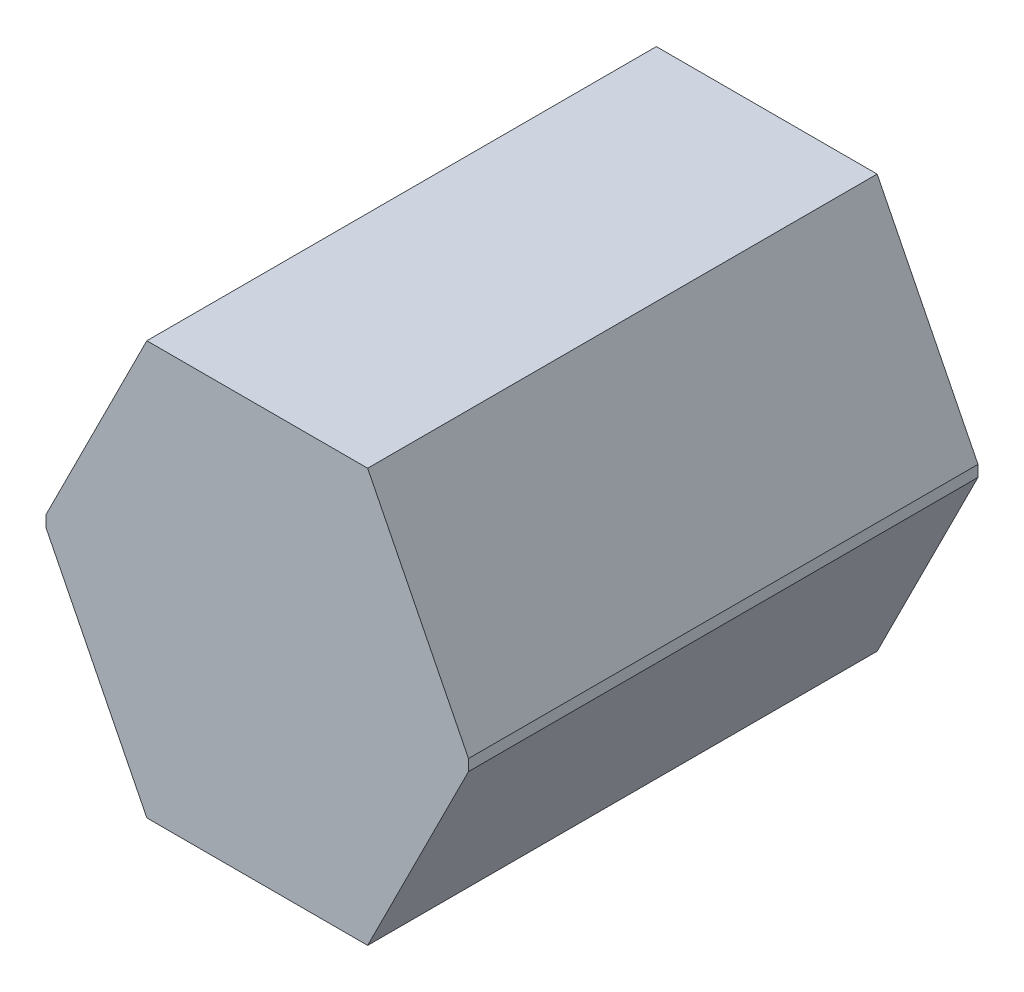
ISO-10303-21;
HEADER;
FILE_DESCRIPTION(('STEP AP214'),'2;1');
FILE_NAME('part.step','',(''),(''),'','','');
FILE_SCHEMA(('AUTOMOTIVE_DESIGN { 1 0 10303 214 1 1 1 1 }'));
ENDSEC;
DATA;
#1=APPLICATION_CONTEXT('core data for automotive mechanical design processes');
#2=APPLICATION_PROTOCOL_DEFINITION('international standard','automotive_design',2000,#1);
#3=PRODUCT_CONTEXT('',#1,'mechanical');
#4=PRODUCT('Part','Part','',(#3));
#5=PRODUCT_RELATED_PRODUCT_CATEGORY('part','',(#4));
#6=PRODUCT_DEFINITION_FORMATION('','',#4);
#7=PRODUCT_DEFINITION_CONTEXT('part definition',#1,'design');
#8=PRODUCT_DEFINITION('design','',#6,#7);
#9=PRODUCT_DEFINITION_SHAPE('','',#8);
#10=(LENGTH_UNIT() NAMED_UNIT(*) SI_UNIT(.MILLI.,.METRE.));
#11=(NAMED_UNIT(*) PLANE_ANGLE_UNIT() SI_UNIT($,.RADIAN.));
#12=(NAMED_UNIT(*) SI_UNIT($,.STERADIAN.) SOLID_ANGLE_UNIT());
#13=UNCERTAINTY_MEASURE_WITH_UNIT(LENGTH_MEASURE(1.E-05),#10,'distance_accuracy_value','');
#14=(GEOMETRIC_REPRESENTATION_CONTEXT(3) GLOBAL_UNCERTAINTY_ASSIGNED_CONTEXT((#13)) GLOBAL_UNIT_ASSIGNED_CONTEXT((#10,
#11,#12)) REPRESENTATION_CONTEXT('',''));
#15=CARTESIAN_POINT('',(0.,0.,0.));
#16=DIRECTION('',(0.,0.,1.));
#17=DIRECTION('',(1.,0.,0.));
#18=AXIS2_PLACEMENT_3D('',#15,#16,#17);
#19=CARTESIAN_POINT('',(97.5,182.5,450.));
#20=DIRECTION('',(-0.893764332552954,-0.448536863430613,0.));
#21=DIRECTION('',(0.448536863430613,-0.893764332552954,0.));
#22=AXIS2_PLACEMENT_3D('',#19,#20,#21);
#23=PLANE('',#22);
#24=DIRECTION('',(-0.448536863430613,0.893764332552954,0.));
#25=VECTOR('',#24,1.);
#26=CARTESIAN_POINT('',(97.5,182.5,0.));
#27=LINE('',#26,#25);
#28=CARTESIAN_POINT('',(186.578619899186,5.,0.));
#29=VERTEX_POINT('',#28);
#30=CARTESIAN_POINT('',(97.5,182.5,0.));
#31=VERTEX_POINT('',#30);
#32=EDGE_CURVE('E133',#29,#31,#27,.T.);
#33=ORIENTED_EDGE('',*,*,#32,.T.);
#34=DIRECTION('',(0.,0.,-1.));
#35=VECTOR('',#34,1.);
#36=CARTESIAN_POINT('',(97.5,182.5,450.));
#37=LINE('',#36,#35);
#38=CARTESIAN_POINT('',(97.5,182.5,450.));
#39=VERTEX_POINT('',#38);
#40=EDGE_CURVE('E11',#39,#31,#37,.T.);
#41=ORIENTED_EDGE('',*,*,#40,.F.);
#42=DIRECTION('',(-0.448536863430613,0.893764332552954,0.));
#43=VECTOR('',#42,1.);
#44=CARTESIAN_POINT('',(97.5,182.5,450.));
#45=LINE('',#44,#43);
#46=CARTESIAN_POINT('',(186.578619899186,5.,450.));
#47=VERTEX_POINT('',#46);
#48=EDGE_CURVE('E147',#47,#39,#45,.T.);
#49=ORIENTED_EDGE('',*,*,#48,.F.);
#50=DIRECTION('',(0.,0.,-1.));
#51=VECTOR('',#50,1.);
#52=CARTESIAN_POINT('',(186.578619899186,5.,450.));
#53=LINE('',#52,#51);
#54=EDGE_CURVE('E129',#47,#29,#53,.T.);
#55=ORIENTED_EDGE('',*,*,#54,.T.);
#56=EDGE_LOOP('',(#33,#41,#49,#55));
#57=FACE_BOUND('',#56,.T.);
#58=ADVANCED_FACE('F37',(#57),#23,.F.);
#59=CARTESIAN_POINT('',(-97.5,182.5,450.));
#60=DIRECTION('',(0.,-1.,0.));
#61=DIRECTION('',(0.,0.,-1.));
#62=AXIS2_PLACEMENT_3D('',#59,#60,#61);
#63=PLANE('',#62);
#64=DIRECTION('',(-1.,0.,0.));
#65=VECTOR('',#64,1.);
#66=CARTESIAN_POINT('',(-97.5,182.5,0.));
#67=LINE('',#66,#65);
#68=CARTESIAN_POINT('',(-97.5,182.5,0.));
#69=VERTEX_POINT('',#68);
#70=EDGE_CURVE('E136',#31,#69,#67,.T.);
#71=ORIENTED_EDGE('',*,*,#70,.T.);
#72=DIRECTION('',(0.,0.,-1.));
#73=VECTOR('',#72,1.);
#74=CARTESIAN_POINT('',(-97.5,182.5,450.));
#75=LINE('',#74,#73);
#76=CARTESIAN_POINT('',(-97.5,182.5,450.));
#77=VERTEX_POINT('',#76);
#78=EDGE_CURVE('E45',#77,#69,#75,.T.);
#79=ORIENTED_EDGE('',*,*,#78,.F.);
#80=DIRECTION('',(-1.,0.,0.));
#81=VECTOR('',#80,1.);
#82=CARTESIAN_POINT('',(-97.5,182.5,450.));
#83=LINE('',#82,#81);
#84=EDGE_CURVE('E96',#39,#77,#83,.T.);
#85=ORIENTED_EDGE('',*,*,#84,.F.);
#86=ORIENTED_EDGE('',*,*,#40,.T.);
#87=EDGE_LOOP('',(#71,#79,#85,#86));
#88=FACE_BOUND('',#87,.T.);
#89=ADVANCED_FACE('F182',(#88),#63,.F.);
#90=CARTESIAN_POINT('',(-97.5,182.5,450.));
#91=DIRECTION('',(0.893764332552954,-0.448536863430613,0.));
#92=DIRECTION('',(0.448536863430613,0.893764332552954,0.));
#93=AXIS2_PLACEMENT_3D('',#90,#91,#92);
#94=PLANE('',#93);
#95=DIRECTION('',(-0.448536863430613,-0.893764332552954,0.));
#96=VECTOR('',#95,1.);
#97=CARTESIAN_POINT('',(-97.5,182.5,0.));
#98=LINE('',#97,#96);
#99=CARTESIAN_POINT('',(-186.578619899186,5.,0.));
#100=VERTEX_POINT('',#99);
#101=EDGE_CURVE('E138',#69,#100,#98,.T.);
#102=ORIENTED_EDGE('',*,*,#101,.T.);
#103=DIRECTION('',(0.,0.,-1.));
#104=VECTOR('',#103,1.);
#105=CARTESIAN_POINT('',(-186.578619899186,5.,450.));
#106=LINE('',#105,#104);
#107=CARTESIAN_POINT('',(-186.578619899186,5.,450.));
#108=VERTEX_POINT('',#107);
#109=EDGE_CURVE('E154',#108,#100,#106,.T.);
#110=ORIENTED_EDGE('',*,*,#109,.F.);
#111=DIRECTION('',(-0.448536863430613,-0.893764332552954,0.));
#112=VECTOR('',#111,1.);
#113=CARTESIAN_POINT('',(-97.5,182.5,450.));
#114=LINE('',#113,#112);
#115=EDGE_CURVE('E162',#77,#108,#114,.T.);
#116=ORIENTED_EDGE('',*,*,#115,.F.);
#117=ORIENTED_EDGE('',*,*,#78,.T.);
#118=EDGE_LOOP('',(#102,#110,#116,#117));
#119=FACE_BOUND('',#118,.T.);
#120=ADVANCED_FACE('F160',(#119),#94,.F.);
#121=CARTESIAN_POINT('',(-186.578619899186,5.,450.));
#122=DIRECTION('',(1.,0.,0.));
#123=DIRECTION('',(0.,0.,-1.));
#124=AXIS2_PLACEMENT_3D('',#121,#122,#123);
#125=PLANE('',#124);
#126=DIRECTION('',(0.,-1.,0.));
#127=VECTOR('',#126,1.);
#128=CARTESIAN_POINT('',(-186.578619899186,5.,0.));
#129=LINE('',#128,#127);
#130=CARTESIAN_POINT('',(-186.578619899186,-5.,0.));
#131=VERTEX_POINT('',#130);
#132=EDGE_CURVE('E140',#100,#131,#129,.T.);
#133=ORIENTED_EDGE('',*,*,#132,.T.);
#134=DIRECTION('',(0.,0.,-1.));
#135=VECTOR('',#134,1.);
#136=CARTESIAN_POINT('',(-186.578619899186,-5.,450.));
#137=LINE('',#136,#135);
#138=CARTESIAN_POINT('',(-186.578619899186,-5.,450.));
#139=VERTEX_POINT('',#138);
#140=EDGE_CURVE('E151',#139,#131,#137,.T.);
#141=ORIENTED_EDGE('',*,*,#140,.F.);
#142=DIRECTION('',(0.,-1.,0.));
#143=VECTOR('',#142,1.);
#144=CARTESIAN_POINT('',(-186.578619899186,5.,450.));
#145=LINE('',#144,#143);
#146=EDGE_CURVE('E174',#108,#139,#145,.T.);
#147=ORIENTED_EDGE('',*,*,#146,.F.);
#148=ORIENTED_EDGE('',*,*,#109,.T.);
#149=EDGE_LOOP('',(#133,#141,#147,#148));
#150=FACE_BOUND('',#149,.T.);
#151=ADVANCED_FACE('F170',(#150),#125,.F.);
#152=CARTESIAN_POINT('',(-97.5,-182.5,450.));
#153=DIRECTION('',(0.893764332552954,0.448536863430613,0.));
#154=DIRECTION('',(-0.448536863430613,0.893764332552954,0.));
#155=AXIS2_PLACEMENT_3D('',#152,#153,#154);
#156=PLANE('',#155);
#157=DIRECTION('',(0.448536863430613,-0.893764332552954,0.));
#158=VECTOR('',#157,1.);
#159=CARTESIAN_POINT('',(-97.5,-182.5,0.));
#160=LINE('',#159,#158);
#161=CARTESIAN_POINT('',(-97.5,-182.5,0.));
#162=VERTEX_POINT('',#161);
#163=EDGE_CURVE('E142',#131,#162,#160,.T.);
#164=ORIENTED_EDGE('',*,*,#163,.T.);
#165=DIRECTION('',(0.,0.,-1.));
#166=VECTOR('',#165,1.);
#167=CARTESIAN_POINT('',(-97.5,-182.5,450.));
#168=LINE('',#167,#166);
#169=CARTESIAN_POINT('',(-97.5,-182.5,450.));
#170=VERTEX_POINT('',#169);
#171=EDGE_CURVE('E124',#170,#162,#168,.T.);
#172=ORIENTED_EDGE('',*,*,#171,.F.);
#173=DIRECTION('',(0.448536863430613,-0.893764332552954,0.));
#174=VECTOR('',#173,1.);
#175=CARTESIAN_POINT('',(-97.5,-182.5,450.));
#176=LINE('',#175,#174);
#177=EDGE_CURVE('E115',#139,#170,#176,.T.);
#178=ORIENTED_EDGE('',*,*,#177,.F.);
#179=ORIENTED_EDGE('',*,*,#140,.T.);
#180=EDGE_LOOP('',(#164,#172,#178,#179));
#181=FACE_BOUND('',#180,.T.);
#182=ADVANCED_FACE('F173',(#181),#156,.F.);
#183=CARTESIAN_POINT('',(-97.5,-182.5,450.));
#184=DIRECTION('',(0.,1.,0.));
#185=DIRECTION('',(0.,0.,1.));
#186=AXIS2_PLACEMENT_3D('',#183,#184,#185);
#187=PLANE('',#186);
#188=DIRECTION('',(1.,0.,0.));
#189=VECTOR('',#188,1.);
#190=CARTESIAN_POINT('',(-97.5,-182.5,0.));
#191=LINE('',#190,#189);
#192=CARTESIAN_POINT('',(97.5,-182.5,0.));
#193=VERTEX_POINT('',#192);
#194=EDGE_CURVE('E123',#162,#193,#191,.T.);
#195=ORIENTED_EDGE('',*,*,#194,.T.);
#196=DIRECTION('',(0.,0.,-1.));
#197=VECTOR('',#196,1.);
#198=CARTESIAN_POINT('',(97.5,-182.5,450.));
#199=LINE('',#198,#197);
#200=CARTESIAN_POINT('',(97.5,-182.5,450.));
#201=VERTEX_POINT('',#200);
#202=EDGE_CURVE('E120',#201,#193,#199,.T.);
#203=ORIENTED_EDGE('',*,*,#202,.F.);
#204=DIRECTION('',(1.,0.,0.));
#205=VECTOR('',#204,1.);
#206=CARTESIAN_POINT('',(-97.5,-182.5,450.));
#207=LINE('',#206,#205);
#208=EDGE_CURVE('E109',#170,#201,#207,.T.);
#209=ORIENTED_EDGE('',*,*,#208,.F.);
#210=ORIENTED_EDGE('',*,*,#171,.T.);
#211=EDGE_LOOP('',(#195,#203,#209,#210));
#212=FACE_BOUND('',#211,.T.);
#213=ADVANCED_FACE('F121',(#212),#187,.F.);
#214=CARTESIAN_POINT('',(97.5,-182.5,450.));
#215=DIRECTION('',(-0.893764332552954,0.448536863430613,0.));
#216=DIRECTION('',(-0.448536863430613,-0.893764332552954,0.));
#217=AXIS2_PLACEMENT_3D('',#214,#215,#216);
#218=PLANE('',#217);
#219=DIRECTION('',(0.448536863430613,0.893764332552954,0.));
#220=VECTOR('',#219,1.);
#221=CARTESIAN_POINT('',(97.5,-182.5,0.));
#222=LINE('',#221,#220);
#223=CARTESIAN_POINT('',(186.578619899186,-5.,0.));
#224=VERTEX_POINT('',#223);
#225=EDGE_CURVE('E82',#193,#224,#222,.T.);
#226=ORIENTED_EDGE('',*,*,#225,.T.);
#227=DIRECTION('',(0.,0.,-1.));
#228=VECTOR('',#227,1.);
#229=CARTESIAN_POINT('',(186.578619899186,-5.,450.));
#230=LINE('',#229,#228);
#231=CARTESIAN_POINT('',(186.578619899186,-5.,450.));
#232=VERTEX_POINT('',#231);
#233=EDGE_CURVE('E125',#232,#224,#230,.T.);
#234=ORIENTED_EDGE('',*,*,#233,.F.);
#235=DIRECTION('',(0.448536863430613,0.893764332552954,0.));
#236=VECTOR('',#235,1.);
#237=CARTESIAN_POINT('',(97.5,-182.5,450.));
#238=LINE('',#237,#236);
#239=EDGE_CURVE('E113',#201,#232,#238,.T.);
#240=ORIENTED_EDGE('',*,*,#239,.F.);
#241=ORIENTED_EDGE('',*,*,#202,.T.);
#242=EDGE_LOOP('',(#226,#234,#240,#241));
#243=FACE_BOUND('',#242,.T.);
#244=ADVANCED_FACE('F127',(#243),#218,.F.);
#245=CARTESIAN_POINT('',(186.578619899186,5.,450.));
#246=DIRECTION('',(-1.,0.,0.));
#247=DIRECTION('',(0.,0.,1.));
#248=AXIS2_PLACEMENT_3D('',#245,#246,#247);
#249=PLANE('',#248);
#250=DIRECTION('',(0.,1.,0.));
#251=VECTOR('',#250,1.);
#252=CARTESIAN_POINT('',(186.578619899186,5.,0.));
#253=LINE('',#252,#251);
#254=EDGE_CURVE('E88',#224,#29,#253,.T.);
#255=ORIENTED_EDGE('',*,*,#254,.T.);
#256=ORIENTED_EDGE('',*,*,#54,.F.);
#257=DIRECTION('',(0.,1.,0.));
#258=VECTOR('',#257,1.);
#259=CARTESIAN_POINT('',(186.578619899186,5.,450.));
#260=LINE('',#259,#258);
#261=EDGE_CURVE('E53',#232,#47,#260,.T.);
#262=ORIENTED_EDGE('',*,*,#261,.F.);
#263=ORIENTED_EDGE('',*,*,#233,.T.);
#264=EDGE_LOOP('',(#255,#256,#262,#263));
#265=FACE_BOUND('',#264,.T.);
#266=ADVANCED_FACE('F198',(#265),#249,.F.);
#267=CARTESIAN_POINT('',(0.,0.,450.));
#268=DIRECTION('',(0.,0.,1.));
#269=DIRECTION('',(1.,0.,0.));
#270=AXIS2_PLACEMENT_3D('',#267,#268,#269);
#271=PLANE('',#270);
#272=ORIENTED_EDGE('',*,*,#48,.T.);
#273=ORIENTED_EDGE('',*,*,#84,.T.);
#274=ORIENTED_EDGE('',*,*,#115,.T.);
#275=ORIENTED_EDGE('',*,*,#146,.T.);
#276=ORIENTED_EDGE('',*,*,#177,.T.);
#277=ORIENTED_EDGE('',*,*,#208,.T.);
#278=ORIENTED_EDGE('',*,*,#239,.T.);
#279=ORIENTED_EDGE('',*,*,#261,.T.);
#280=EDGE_LOOP('',(#272,#273,#274,#275,#276,#277,#278,#279));
#281=FACE_BOUND('',#280,.T.);
#282=ADVANCED_FACE('F111',(#281),#271,.T.);
#283=CARTESIAN_POINT('',(0.,0.,0.));
#284=DIRECTION('',(0.,0.,1.));
#285=DIRECTION('',(1.,0.,0.));
#286=AXIS2_PLACEMENT_3D('',#283,#284,#285);
#287=PLANE('',#286);
#288=ORIENTED_EDGE('',*,*,#32,.F.);
#289=ORIENTED_EDGE('',*,*,#254,.F.);
#290=ORIENTED_EDGE('',*,*,#225,.F.);
#291=ORIENTED_EDGE('',*,*,#194,.F.);
#292=ORIENTED_EDGE('',*,*,#163,.F.);
#293=ORIENTED_EDGE('',*,*,#132,.F.);
#294=ORIENTED_EDGE('',*,*,#101,.F.);
#295=ORIENTED_EDGE('',*,*,#70,.F.);
#296=EDGE_LOOP('',(#288,#289,#290,#291,#292,#293,#294,#295));
#297=FACE_BOUND('',#296,.T.);
#298=ADVANCED_FACE('F166',(#297),#287,.F.);
#299=CLOSED_SHELL('',(#58,#89,#120,#151,#182,#213,#244,#266,#282,#298));
#300=MANIFOLD_SOLID_BREP('B2',#299);
#301=ADVANCED_BREP_SHAPE_REPRESENTATION('',(#18,#300),#14);
#302=SHAPE_DEFINITION_REPRESENTATION(#9,#301);
ENDSEC;
END-ISO-10303-21;
